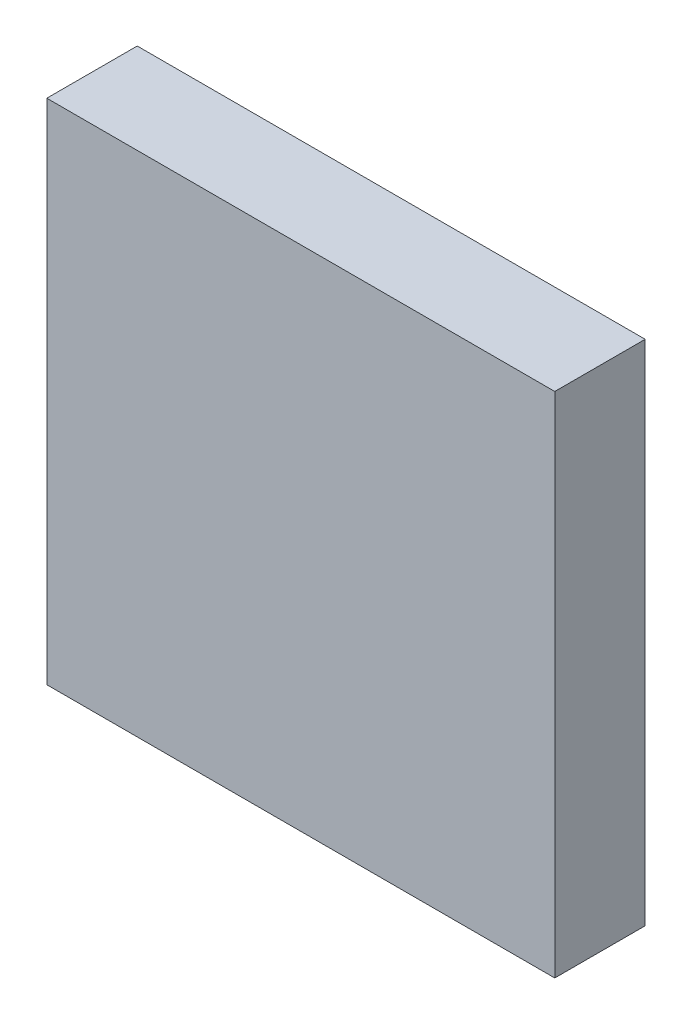
ISO-10303-21;
HEADER;
FILE_DESCRIPTION(('STEP AP214'),'2;1');
FILE_NAME('part.step','',(''),(''),'','','');
FILE_SCHEMA(('AUTOMOTIVE_DESIGN { 1 0 10303 214 1 1 1 1 }'));
ENDSEC;
DATA;
#1=APPLICATION_CONTEXT('core data for automotive mechanical design processes');
#2=APPLICATION_PROTOCOL_DEFINITION('international standard','automotive_design',2000,#1);
#3=PRODUCT_CONTEXT('',#1,'mechanical');
#4=PRODUCT('Part','Part','',(#3));
#5=PRODUCT_RELATED_PRODUCT_CATEGORY('part','',(#4));
#6=PRODUCT_DEFINITION_FORMATION('','',#4);
#7=PRODUCT_DEFINITION_CONTEXT('part definition',#1,'design');
#8=PRODUCT_DEFINITION('design','',#6,#7);
#9=PRODUCT_DEFINITION_SHAPE('','',#8);
#10=(LENGTH_UNIT() NAMED_UNIT(*) SI_UNIT(.MILLI.,.METRE.));
#11=(NAMED_UNIT(*) PLANE_ANGLE_UNIT() SI_UNIT($,.RADIAN.));
#12=(NAMED_UNIT(*) SI_UNIT($,.STERADIAN.) SOLID_ANGLE_UNIT());
#13=UNCERTAINTY_MEASURE_WITH_UNIT(LENGTH_MEASURE(1.E-05),#10,'distance_accuracy_value','');
#14=(GEOMETRIC_REPRESENTATION_CONTEXT(3) GLOBAL_UNCERTAINTY_ASSIGNED_CONTEXT((#13)) GLOBAL_UNIT_ASSIGNED_CONTEXT((#10,
#11,#12)) REPRESENTATION_CONTEXT('',''));
#15=CARTESIAN_POINT('',(0.,0.,0.));
#16=DIRECTION('',(0.,0.,1.));
#17=DIRECTION('',(1.,0.,0.));
#18=AXIS2_PLACEMENT_3D('',#15,#16,#17);
#19=CARTESIAN_POINT('',(-2.50000008,-2.50000008,0.89000076));
#20=DIRECTION('',(0.,0.,1.));
#21=DIRECTION('',(1.,0.,0.));
#22=AXIS2_PLACEMENT_3D('',#19,#20,#21);
#23=PLANE('',#22);
#24=DIRECTION('',(0.,1.,0.));
#25=VECTOR('',#24,1.);
#26=CARTESIAN_POINT('',(-2.50000008,-2.50000008,0.89000076));
#27=LINE('',#26,#25);
#28=CARTESIAN_POINT('',(-2.50000008,-2.50000008,0.89000076));
#29=VERTEX_POINT('',#28);
#30=CARTESIAN_POINT('',(-2.50000008,2.50000008,0.89000076));
#31=VERTEX_POINT('',#30);
#32=EDGE_CURVE('E105',#29,#31,#27,.T.);
#33=ORIENTED_EDGE('',*,*,#32,.F.);
#34=DIRECTION('',(-1.,0.,0.));
#35=VECTOR('',#34,1.);
#36=CARTESIAN_POINT('',(2.50000008,-2.50000008,0.89000076));
#37=LINE('',#36,#35);
#38=CARTESIAN_POINT('',(2.50000008,-2.50000008,0.89000076));
#39=VERTEX_POINT('',#38);
#40=EDGE_CURVE('E28',#39,#29,#37,.T.);
#41=ORIENTED_EDGE('',*,*,#40,.F.);
#42=DIRECTION('',(0.,-1.,0.));
#43=VECTOR('',#42,1.);
#44=CARTESIAN_POINT('',(2.50000008,2.50000008,0.89000076));
#45=LINE('',#44,#43);
#46=CARTESIAN_POINT('',(2.50000008,2.50000008,0.89000076));
#47=VERTEX_POINT('',#46);
#48=EDGE_CURVE('E75',#47,#39,#45,.T.);
#49=ORIENTED_EDGE('',*,*,#48,.F.);
#50=DIRECTION('',(1.,0.,0.));
#51=VECTOR('',#50,1.);
#52=CARTESIAN_POINT('',(-2.50000008,2.50000008,0.89000076));
#53=LINE('',#52,#51);
#54=EDGE_CURVE('E21',#31,#47,#53,.T.);
#55=ORIENTED_EDGE('',*,*,#54,.F.);
#56=EDGE_LOOP('',(#33,#41,#49,#55));
#57=FACE_BOUND('',#56,.T.);
#58=ADVANCED_FACE('F17',(#57),#23,.T.);
#59=CARTESIAN_POINT('',(-2.50000008,-2.50000008,0.));
#60=DIRECTION('',(0.,0.,1.));
#61=DIRECTION('',(1.,0.,0.));
#62=AXIS2_PLACEMENT_3D('',#59,#60,#61);
#63=PLANE('',#62);
#64=DIRECTION('',(0.,1.,0.));
#65=VECTOR('',#64,1.);
#66=CARTESIAN_POINT('',(-2.50000008,-2.50000008,0.));
#67=LINE('',#66,#65);
#68=CARTESIAN_POINT('',(-2.50000008,-2.50000008,0.));
#69=VERTEX_POINT('',#68);
#70=CARTESIAN_POINT('',(-2.50000008,2.50000008,0.));
#71=VERTEX_POINT('',#70);
#72=EDGE_CURVE('E94',#69,#71,#67,.T.);
#73=ORIENTED_EDGE('',*,*,#72,.T.);
#74=DIRECTION('',(1.,0.,0.));
#75=VECTOR('',#74,1.);
#76=CARTESIAN_POINT('',(-2.50000008,2.50000008,0.));
#77=LINE('',#76,#75);
#78=CARTESIAN_POINT('',(2.50000008,2.50000008,0.));
#79=VERTEX_POINT('',#78);
#80=EDGE_CURVE('E68',#71,#79,#77,.T.);
#81=ORIENTED_EDGE('',*,*,#80,.T.);
#82=DIRECTION('',(0.,-1.,0.));
#83=VECTOR('',#82,1.);
#84=CARTESIAN_POINT('',(2.50000008,2.50000008,0.));
#85=LINE('',#84,#83);
#86=CARTESIAN_POINT('',(2.50000008,-2.50000008,0.));
#87=VERTEX_POINT('',#86);
#88=EDGE_CURVE('E86',#79,#87,#85,.T.);
#89=ORIENTED_EDGE('',*,*,#88,.T.);
#90=DIRECTION('',(-1.,0.,0.));
#91=VECTOR('',#90,1.);
#92=CARTESIAN_POINT('',(2.50000008,-2.50000008,0.));
#93=LINE('',#92,#91);
#94=EDGE_CURVE('E11',#87,#69,#93,.T.);
#95=ORIENTED_EDGE('',*,*,#94,.T.);
#96=EDGE_LOOP('',(#73,#81,#89,#95));
#97=FACE_BOUND('',#96,.T.);
#98=ADVANCED_FACE('F125',(#97),#63,.F.);
#99=CARTESIAN_POINT('',(2.50000008,-2.50000008,0.));
#100=DIRECTION('',(0.,-1.,0.));
#101=DIRECTION('',(0.,0.,-1.));
#102=AXIS2_PLACEMENT_3D('',#99,#100,#101);
#103=PLANE('',#102);
#104=DIRECTION('',(0.,0.,1.));
#105=VECTOR('',#104,1.);
#106=CARTESIAN_POINT('',(2.50000008,-2.50000008,0.));
#107=LINE('',#106,#105);
#108=EDGE_CURVE('E82',#87,#39,#107,.T.);
#109=ORIENTED_EDGE('',*,*,#108,.T.);
#110=ORIENTED_EDGE('',*,*,#40,.T.);
#111=DIRECTION('',(0.,0.,1.));
#112=VECTOR('',#111,1.);
#113=CARTESIAN_POINT('',(-2.50000008,-2.50000008,0.));
#114=LINE('',#113,#112);
#115=EDGE_CURVE('E112',#69,#29,#114,.T.);
#116=ORIENTED_EDGE('',*,*,#115,.F.);
#117=ORIENTED_EDGE('',*,*,#94,.F.);
#118=EDGE_LOOP('',(#109,#110,#116,#117));
#119=FACE_BOUND('',#118,.T.);
#120=ADVANCED_FACE('F19',(#119),#103,.T.);
#121=CARTESIAN_POINT('',(2.50000008,2.50000008,0.));
#122=DIRECTION('',(1.,0.,0.));
#123=DIRECTION('',(0.,1.,0.));
#124=AXIS2_PLACEMENT_3D('',#121,#122,#123);
#125=PLANE('',#124);
#126=DIRECTION('',(0.,0.,1.));
#127=VECTOR('',#126,1.);
#128=CARTESIAN_POINT('',(2.50000008,2.50000008,0.));
#129=LINE('',#128,#127);
#130=EDGE_CURVE('E84',#79,#47,#129,.T.);
#131=ORIENTED_EDGE('',*,*,#130,.T.);
#132=ORIENTED_EDGE('',*,*,#48,.T.);
#133=ORIENTED_EDGE('',*,*,#108,.F.);
#134=ORIENTED_EDGE('',*,*,#88,.F.);
#135=EDGE_LOOP('',(#131,#132,#133,#134));
#136=FACE_BOUND('',#135,.T.);
#137=ADVANCED_FACE('F85',(#136),#125,.T.);
#138=CARTESIAN_POINT('',(-2.50000008,2.50000008,0.));
#139=DIRECTION('',(0.,1.,0.));
#140=DIRECTION('',(1.,0.,0.));
#141=AXIS2_PLACEMENT_3D('',#138,#139,#140);
#142=PLANE('',#141);
#143=DIRECTION('',(0.,0.,1.));
#144=VECTOR('',#143,1.);
#145=CARTESIAN_POINT('',(-2.50000008,2.50000008,0.));
#146=LINE('',#145,#144);
#147=EDGE_CURVE('E91',#71,#31,#146,.T.);
#148=ORIENTED_EDGE('',*,*,#147,.T.);
#149=ORIENTED_EDGE('',*,*,#54,.T.);
#150=ORIENTED_EDGE('',*,*,#130,.F.);
#151=ORIENTED_EDGE('',*,*,#80,.F.);
#152=EDGE_LOOP('',(#148,#149,#150,#151));
#153=FACE_BOUND('',#152,.T.);
#154=ADVANCED_FACE('F89',(#153),#142,.T.);
#155=CARTESIAN_POINT('',(-2.50000008,-2.50000008,0.));
#156=DIRECTION('',(-1.,0.,0.));
#157=DIRECTION('',(0.,0.,1.));
#158=AXIS2_PLACEMENT_3D('',#155,#156,#157);
#159=PLANE('',#158);
#160=ORIENTED_EDGE('',*,*,#115,.T.);
#161=ORIENTED_EDGE('',*,*,#32,.T.);
#162=ORIENTED_EDGE('',*,*,#147,.F.);
#163=ORIENTED_EDGE('',*,*,#72,.F.);
#164=EDGE_LOOP('',(#160,#161,#162,#163));
#165=FACE_BOUND('',#164,.T.);
#166=ADVANCED_FACE('F123',(#165),#159,.T.);
#167=CLOSED_SHELL('',(#58,#98,#120,#137,#154,#166));
#168=MANIFOLD_SOLID_BREP('B1',#167);
#169=ADVANCED_BREP_SHAPE_REPRESENTATION('',(#18,#168),#14);
#170=SHAPE_DEFINITION_REPRESENTATION(#9,#169);
ENDSEC;
END-ISO-10303-21;
